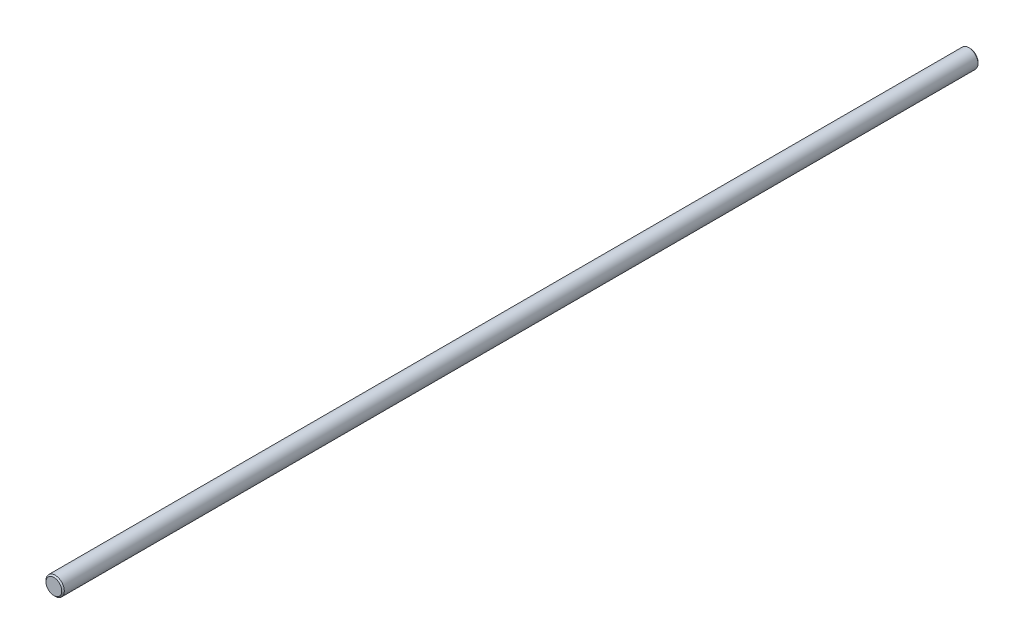
ISO-10303-21;
HEADER;
FILE_DESCRIPTION(('STEP AP214'),'2;1');
FILE_NAME('part.step','',(''),(''),'','','');
FILE_SCHEMA(('AUTOMOTIVE_DESIGN { 1 0 10303 214 1 1 1 1 }'));
ENDSEC;
DATA;
#1=APPLICATION_CONTEXT('core data for automotive mechanical design processes');
#2=APPLICATION_PROTOCOL_DEFINITION('international standard','automotive_design',2000,#1);
#3=PRODUCT_CONTEXT('',#1,'mechanical');
#4=PRODUCT('Part','Part','',(#3));
#5=PRODUCT_RELATED_PRODUCT_CATEGORY('part','',(#4));
#6=PRODUCT_DEFINITION_FORMATION('','',#4);
#7=PRODUCT_DEFINITION_CONTEXT('part definition',#1,'design');
#8=PRODUCT_DEFINITION('design','',#6,#7);
#9=PRODUCT_DEFINITION_SHAPE('','',#8);
#10=(LENGTH_UNIT() NAMED_UNIT(*) SI_UNIT(.MILLI.,.METRE.));
#11=(NAMED_UNIT(*) PLANE_ANGLE_UNIT() SI_UNIT($,.RADIAN.));
#12=(NAMED_UNIT(*) SI_UNIT($,.STERADIAN.) SOLID_ANGLE_UNIT());
#13=UNCERTAINTY_MEASURE_WITH_UNIT(LENGTH_MEASURE(1.E-05),#10,'distance_accuracy_value','');
#14=(GEOMETRIC_REPRESENTATION_CONTEXT(3) GLOBAL_UNCERTAINTY_ASSIGNED_CONTEXT((#13)) GLOBAL_UNIT_ASSIGNED_CONTEXT((#10,
#11,#12)) REPRESENTATION_CONTEXT('',''));
#15=CARTESIAN_POINT('',(0.,0.,0.));
#16=DIRECTION('',(0.,0.,1.));
#17=DIRECTION('',(1.,0.,0.));
#18=AXIS2_PLACEMENT_3D('',#15,#16,#17);
#19=CARTESIAN_POINT('',(0.,0.,150.));
#20=DIRECTION('',(0.,0.,-1.));
#21=DIRECTION('',(-1.,0.,0.));
#22=AXIS2_PLACEMENT_3D('',#19,#20,#21);
#23=CYLINDRICAL_SURFACE('',#22,3.);
#24=CARTESIAN_POINT('',(0.,0.,-149.58));
#25=DIRECTION('',(0.,0.,1.));
#26=DIRECTION('',(1.,0.,0.));
#27=AXIS2_PLACEMENT_3D('',#24,#25,#26);
#28=CIRCLE('',#27,3.);
#29=CARTESIAN_POINT('',(3.,0.,-149.58));
#30=VERTEX_POINT('',#29);
#31=EDGE_CURVE('E46',#30,#30,#28,.T.);
#32=ORIENTED_EDGE('',*,*,#31,.T.);
#33=EDGE_LOOP('',(#32));
#34=FACE_BOUND('',#33,.T.);
#35=CARTESIAN_POINT('',(0.,0.,149.58));
#36=DIRECTION('',(0.,0.,1.));
#37=DIRECTION('',(1.,0.,0.));
#38=AXIS2_PLACEMENT_3D('',#35,#36,#37);
#39=CIRCLE('',#38,3.);
#40=CARTESIAN_POINT('',(3.,0.,149.58));
#41=VERTEX_POINT('',#40);
#42=EDGE_CURVE('E50',#41,#41,#39,.F.);
#43=ORIENTED_EDGE('',*,*,#42,.T.);
#44=EDGE_LOOP('',(#43));
#45=FACE_BOUND('',#44,.T.);
#46=ADVANCED_FACE('F35',(#34,#45),#23,.T.);
#47=CARTESIAN_POINT('',(0.,0.,150.));
#48=DIRECTION('',(0.,0.,1.));
#49=DIRECTION('',(1.,0.,0.));
#50=AXIS2_PLACEMENT_3D('',#47,#48,#49);
#51=PLANE('',#50);
#52=CARTESIAN_POINT('',(0.,0.,150.));
#53=DIRECTION('',(0.,0.,1.));
#54=DIRECTION('',(1.,0.,0.));
#55=AXIS2_PLACEMENT_3D('',#52,#53,#54);
#56=CIRCLE('',#55,2.58);
#57=CARTESIAN_POINT('',(2.58,0.,150.));
#58=VERTEX_POINT('',#57);
#59=EDGE_CURVE('E10',#58,#58,#56,.T.);
#60=ORIENTED_EDGE('',*,*,#59,.T.);
#61=EDGE_LOOP('',(#60));
#62=FACE_BOUND('',#61,.T.);
#63=ADVANCED_FACE('F66',(#62),#51,.T.);
#64=CARTESIAN_POINT('',(0.,0.,-150.));
#65=DIRECTION('',(0.,0.,1.));
#66=DIRECTION('',(1.,0.,0.));
#67=AXIS2_PLACEMENT_3D('',#64,#65,#66);
#68=PLANE('',#67);
#69=CARTESIAN_POINT('',(0.,0.,-150.));
#70=DIRECTION('',(0.,0.,1.));
#71=DIRECTION('',(1.,0.,0.));
#72=AXIS2_PLACEMENT_3D('',#69,#70,#71);
#73=CIRCLE('',#72,2.57999999999994);
#74=CARTESIAN_POINT('',(2.57999999999994,0.,-150.));
#75=VERTEX_POINT('',#74);
#76=EDGE_CURVE('E42',#75,#75,#73,.F.);
#77=ORIENTED_EDGE('',*,*,#76,.T.);
#78=EDGE_LOOP('',(#77));
#79=FACE_BOUND('',#78,.T.);
#80=ADVANCED_FACE('F63',(#79),#68,.F.);
#81=CARTESIAN_POINT('',(0.,0.,-149.58));
#82=DIRECTION('',(0.,0.,1.));
#83=DIRECTION('',(1.,0.,0.));
#84=AXIS2_PLACEMENT_3D('',#81,#82,#83);
#85=CONICAL_SURFACE('',#84,3.,0.785398163397479);
#86=ORIENTED_EDGE('',*,*,#76,.F.);
#87=EDGE_LOOP('',(#86));
#88=FACE_BOUND('',#87,.T.);
#89=ORIENTED_EDGE('',*,*,#31,.F.);
#90=EDGE_LOOP('',(#89));
#91=FACE_BOUND('',#90,.T.);
#92=ADVANCED_FACE('F59',(#88,#91),#85,.T.);
#93=CARTESIAN_POINT('',(0.,0.,150.));
#94=DIRECTION('',(0.,0.,-1.));
#95=DIRECTION('',(-1.,0.,0.));
#96=AXIS2_PLACEMENT_3D('',#93,#94,#95);
#97=CONICAL_SURFACE('',#96,2.58,0.785398163397445);
#98=ORIENTED_EDGE('',*,*,#42,.F.);
#99=EDGE_LOOP('',(#98));
#100=FACE_BOUND('',#99,.T.);
#101=ORIENTED_EDGE('',*,*,#59,.F.);
#102=EDGE_LOOP('',(#101));
#103=FACE_BOUND('',#102,.T.);
#104=ADVANCED_FACE('F37',(#100,#103),#97,.T.);
#105=CLOSED_SHELL('',(#46,#63,#80,#92,#104));
#106=MANIFOLD_SOLID_BREP('B2',#105);
#107=ADVANCED_BREP_SHAPE_REPRESENTATION('',(#18,#106),#14);
#108=SHAPE_DEFINITION_REPRESENTATION(#9,#107);
ENDSEC;
END-ISO-10303-21;
